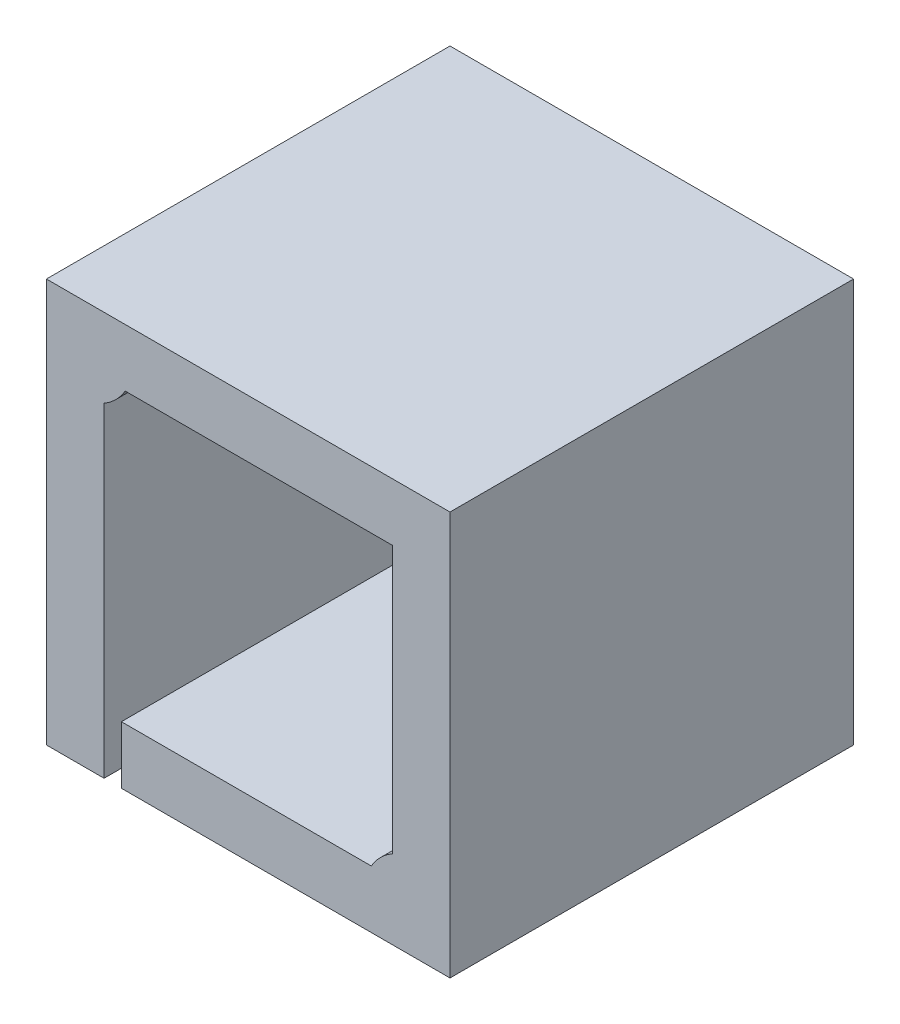
ISO-10303-21;
HEADER;
FILE_DESCRIPTION(('STEP AP214'),'2;1');
FILE_NAME('part.step','',(''),(''),'','','');
FILE_SCHEMA(('AUTOMOTIVE_DESIGN { 1 0 10303 214 1 1 1 1 }'));
ENDSEC;
DATA;
#1=APPLICATION_CONTEXT('core data for automotive mechanical design processes');
#2=APPLICATION_PROTOCOL_DEFINITION('international standard','automotive_design',2000,#1);
#3=PRODUCT_CONTEXT('',#1,'mechanical');
#4=PRODUCT('Part','Part','',(#3));
#5=PRODUCT_RELATED_PRODUCT_CATEGORY('part','',(#4));
#6=PRODUCT_DEFINITION_FORMATION('','',#4);
#7=PRODUCT_DEFINITION_CONTEXT('part definition',#1,'design');
#8=PRODUCT_DEFINITION('design','',#6,#7);
#9=PRODUCT_DEFINITION_SHAPE('','',#8);
#10=(LENGTH_UNIT() NAMED_UNIT(*) SI_UNIT(.MILLI.,.METRE.));
#11=(NAMED_UNIT(*) PLANE_ANGLE_UNIT() SI_UNIT($,.RADIAN.));
#12=(NAMED_UNIT(*) SI_UNIT($,.STERADIAN.) SOLID_ANGLE_UNIT());
#13=UNCERTAINTY_MEASURE_WITH_UNIT(LENGTH_MEASURE(1.E-05),#10,'distance_accuracy_value','');
#14=(GEOMETRIC_REPRESENTATION_CONTEXT(3) GLOBAL_UNCERTAINTY_ASSIGNED_CONTEXT((#13)) GLOBAL_UNIT_ASSIGNED_CONTEXT((#10,
#11,#12)) REPRESENTATION_CONTEXT('',''));
#15=CARTESIAN_POINT('',(0.,0.,0.));
#16=DIRECTION('',(0.,0.,1.));
#17=DIRECTION('',(1.,0.,0.));
#18=AXIS2_PLACEMENT_3D('',#15,#16,#17);
#19=CARTESIAN_POINT('',(-3.,6.5,0.));
#20=DIRECTION('',(0.,0.,1.));
#21=DIRECTION('',(1.,0.,0.));
#22=AXIS2_PLACEMENT_3D('',#19,#20,#21);
#23=CYLINDRICAL_SURFACE('',#22,1.);
#24=DIRECTION('',(0.,0.,-1.));
#25=VECTOR('',#24,1.);
#26=CARTESIAN_POINT('',(-2.133974596216,6.,0.));
#27=LINE('',#26,#25);
#28=CARTESIAN_POINT('',(-2.13397459621578,6.,0.));
#29=VERTEX_POINT('',#28);
#30=CARTESIAN_POINT('',(-2.13397459621578,6.,-7.));
#31=VERTEX_POINT('',#30);
#32=EDGE_CURVE('E107',#29,#31,#27,.T.);
#33=ORIENTED_EDGE('',*,*,#32,.F.);
#34=CARTESIAN_POINT('',(-3.,6.5,0.));
#35=DIRECTION('',(0.,0.,1.));
#36=DIRECTION('',(1.,0.,0.));
#37=AXIS2_PLACEMENT_3D('',#34,#35,#36);
#38=CIRCLE('',#37,1.);
#39=CARTESIAN_POINT('',(-2.5,5.63397459621578,0.));
#40=VERTEX_POINT('',#39);
#41=EDGE_CURVE('E112',#29,#40,#38,.F.);
#42=ORIENTED_EDGE('',*,*,#41,.T.);
#43=DIRECTION('',(0.,0.,1.));
#44=VECTOR('',#43,1.);
#45=CARTESIAN_POINT('',(-2.5,5.633974596216,0.));
#46=LINE('',#45,#44);
#47=CARTESIAN_POINT('',(-2.5,5.63397459621578,-7.));
#48=VERTEX_POINT('',#47);
#49=EDGE_CURVE('E110',#48,#40,#46,.T.);
#50=ORIENTED_EDGE('',*,*,#49,.F.);
#51=CARTESIAN_POINT('',(-3.,6.5,-7.));
#52=DIRECTION('',(0.,0.,1.));
#53=DIRECTION('',(1.,0.,0.));
#54=AXIS2_PLACEMENT_3D('',#51,#52,#53);
#55=CIRCLE('',#54,1.);
#56=EDGE_CURVE('E19',#48,#31,#55,.T.);
#57=ORIENTED_EDGE('',*,*,#56,.T.);
#58=EDGE_LOOP('',(#33,#42,#50,#57));
#59=FACE_BOUND('',#58,.T.);
#60=ADVANCED_FACE('F16',(#59),#23,.T.);
#61=CARTESIAN_POINT('',(3.,0.5,0.));
#62=DIRECTION('',(0.,0.,1.));
#63=DIRECTION('',(1.,0.,0.));
#64=AXIS2_PLACEMENT_3D('',#61,#62,#63);
#65=CYLINDRICAL_SURFACE('',#64,1.);
#66=DIRECTION('',(0.,0.,1.));
#67=VECTOR('',#66,1.);
#68=CARTESIAN_POINT('',(2.133974596216,1.,0.));
#69=LINE('',#68,#67);
#70=CARTESIAN_POINT('',(2.13397459621578,1.,0.));
#71=VERTEX_POINT('',#70);
#72=CARTESIAN_POINT('',(2.13397459621578,1.,-7.));
#73=VERTEX_POINT('',#72);
#74=EDGE_CURVE('E138',#71,#73,#69,.F.);
#75=ORIENTED_EDGE('',*,*,#74,.F.);
#76=CARTESIAN_POINT('',(3.,0.5,0.));
#77=DIRECTION('',(0.,0.,1.));
#78=DIRECTION('',(1.,0.,0.));
#79=AXIS2_PLACEMENT_3D('',#76,#77,#78);
#80=CIRCLE('',#79,1.);
#81=CARTESIAN_POINT('',(2.5,1.36602540378422,0.));
#82=VERTEX_POINT('',#81);
#83=EDGE_CURVE('E173',#71,#82,#80,.F.);
#84=ORIENTED_EDGE('',*,*,#83,.T.);
#85=DIRECTION('',(0.,0.,1.));
#86=VECTOR('',#85,1.);
#87=CARTESIAN_POINT('',(2.5,1.366025403784,0.));
#88=LINE('',#87,#86);
#89=CARTESIAN_POINT('',(2.5,1.36602540378422,-7.));
#90=VERTEX_POINT('',#89);
#91=EDGE_CURVE('E142',#90,#82,#88,.T.);
#92=ORIENTED_EDGE('',*,*,#91,.F.);
#93=CARTESIAN_POINT('',(3.,0.5,-7.));
#94=DIRECTION('',(0.,0.,1.));
#95=DIRECTION('',(1.,0.,0.));
#96=AXIS2_PLACEMENT_3D('',#93,#94,#95);
#97=CIRCLE('',#96,1.);
#98=EDGE_CURVE('E207',#90,#73,#97,.T.);
#99=ORIENTED_EDGE('',*,*,#98,.T.);
#100=EDGE_LOOP('',(#75,#84,#92,#99));
#101=FACE_BOUND('',#100,.T.);
#102=ADVANCED_FACE('F271',(#101),#65,.T.);
#103=CARTESIAN_POINT('',(-3.5,0.,0.));
#104=DIRECTION('',(0.,-1.,0.));
#105=DIRECTION('',(0.,0.,-1.));
#106=AXIS2_PLACEMENT_3D('',#103,#104,#105);
#107=PLANE('',#106);
#108=DIRECTION('',(0.,0.,1.));
#109=VECTOR('',#108,1.);
#110=CARTESIAN_POINT('',(-2.5,0.,0.));
#111=LINE('',#110,#109);
#112=CARTESIAN_POINT('',(-2.5,0.,0.));
#113=VERTEX_POINT('',#112);
#114=CARTESIAN_POINT('',(-2.5,0.,-7.));
#115=VERTEX_POINT('',#114);
#116=EDGE_CURVE('E154',#113,#115,#111,.F.);
#117=ORIENTED_EDGE('',*,*,#116,.F.);
#118=DIRECTION('',(1.,0.,0.));
#119=VECTOR('',#118,1.);
#120=CARTESIAN_POINT('',(-3.5,0.,0.));
#121=LINE('',#120,#119);
#122=CARTESIAN_POINT('',(-3.5,0.,0.));
#123=VERTEX_POINT('',#122);
#124=EDGE_CURVE('E162',#113,#123,#121,.F.);
#125=ORIENTED_EDGE('',*,*,#124,.T.);
#126=DIRECTION('',(0.,0.,1.));
#127=VECTOR('',#126,1.);
#128=CARTESIAN_POINT('',(-3.5,0.,0.));
#129=LINE('',#128,#127);
#130=CARTESIAN_POINT('',(-3.5,0.,-7.));
#131=VERTEX_POINT('',#130);
#132=EDGE_CURVE('E145',#131,#123,#129,.T.);
#133=ORIENTED_EDGE('',*,*,#132,.F.);
#134=DIRECTION('',(1.,0.,0.));
#135=VECTOR('',#134,1.);
#136=CARTESIAN_POINT('',(-3.5,0.,-7.));
#137=LINE('',#136,#135);
#138=EDGE_CURVE('E169',#131,#115,#137,.T.);
#139=ORIENTED_EDGE('',*,*,#138,.T.);
#140=EDGE_LOOP('',(#117,#125,#133,#139));
#141=FACE_BOUND('',#140,.T.);
#142=ADVANCED_FACE('F269',(#141),#107,.T.);
#143=CARTESIAN_POINT('',(-2.2,1.,0.));
#144=DIRECTION('',(-1.,0.,0.));
#145=DIRECTION('',(0.,0.,1.));
#146=AXIS2_PLACEMENT_3D('',#143,#144,#145);
#147=PLANE('',#146);
#148=DIRECTION('',(0.,0.,-1.));
#149=VECTOR('',#148,1.);
#150=CARTESIAN_POINT('',(-2.2,0.,0.));
#151=LINE('',#150,#149);
#152=CARTESIAN_POINT('',(-2.2,0.,0.));
#153=VERTEX_POINT('',#152);
#154=CARTESIAN_POINT('',(-2.2,0.,-7.));
#155=VERTEX_POINT('',#154);
#156=EDGE_CURVE('E129',#153,#155,#151,.T.);
#157=ORIENTED_EDGE('',*,*,#156,.F.);
#158=DIRECTION('',(0.,1.,0.));
#159=VECTOR('',#158,1.);
#160=CARTESIAN_POINT('',(-2.2,1.,0.));
#161=LINE('',#160,#159);
#162=CARTESIAN_POINT('',(-2.2,1.,0.));
#163=VERTEX_POINT('',#162);
#164=EDGE_CURVE('E157',#153,#163,#161,.T.);
#165=ORIENTED_EDGE('',*,*,#164,.T.);
#166=DIRECTION('',(0.,0.,1.));
#167=VECTOR('',#166,1.);
#168=CARTESIAN_POINT('',(-2.2,1.,0.));
#169=LINE('',#168,#167);
#170=CARTESIAN_POINT('',(-2.2,1.,-7.));
#171=VERTEX_POINT('',#170);
#172=EDGE_CURVE('E141',#171,#163,#169,.T.);
#173=ORIENTED_EDGE('',*,*,#172,.F.);
#174=DIRECTION('',(0.,1.,0.));
#175=VECTOR('',#174,1.);
#176=CARTESIAN_POINT('',(-2.2,1.,-7.));
#177=LINE('',#176,#175);
#178=EDGE_CURVE('E160',#171,#155,#177,.F.);
#179=ORIENTED_EDGE('',*,*,#178,.T.);
#180=EDGE_LOOP('',(#157,#165,#173,#179));
#181=FACE_BOUND('',#180,.T.);
#182=ADVANCED_FACE('F243',(#181),#147,.T.);
#183=CARTESIAN_POINT('',(-2.5,0.,0.));
#184=DIRECTION('',(1.,0.,0.));
#185=DIRECTION('',(0.,1.,0.));
#186=AXIS2_PLACEMENT_3D('',#183,#184,#185);
#187=PLANE('',#186);
#188=ORIENTED_EDGE('',*,*,#49,.T.);
#189=DIRECTION('',(0.,1.,0.));
#190=VECTOR('',#189,1.);
#191=CARTESIAN_POINT('',(-2.5,3.414253808474,0.));
#192=LINE('',#191,#190);
#193=EDGE_CURVE('E213',#113,#40,#192,.T.);
#194=ORIENTED_EDGE('',*,*,#193,.F.);
#195=ORIENTED_EDGE('',*,*,#116,.T.);
#196=DIRECTION('',(0.,1.,0.));
#197=VECTOR('',#196,1.);
#198=CARTESIAN_POINT('',(-2.5,3.414253808474,-7.));
#199=LINE('',#198,#197);
#200=EDGE_CURVE('E125',#115,#48,#199,.T.);
#201=ORIENTED_EDGE('',*,*,#200,.T.);
#202=EDGE_LOOP('',(#188,#194,#195,#201));
#203=FACE_BOUND('',#202,.T.);
#204=ADVANCED_FACE('F212',(#203),#187,.T.);
#205=CARTESIAN_POINT('',(-2.133974596216,6.,0.));
#206=DIRECTION('',(0.,-1.,0.));
#207=DIRECTION('',(0.,0.,-1.));
#208=AXIS2_PLACEMENT_3D('',#205,#206,#207);
#209=PLANE('',#208);
#210=DIRECTION('',(0.,0.,1.));
#211=VECTOR('',#210,1.);
#212=CARTESIAN_POINT('',(2.5,6.,0.));
#213=LINE('',#212,#211);
#214=CARTESIAN_POINT('',(2.5,6.,0.));
#215=VERTEX_POINT('',#214);
#216=CARTESIAN_POINT('',(2.5,6.,-7.));
#217=VERTEX_POINT('',#216);
#218=EDGE_CURVE('E119',#215,#217,#213,.F.);
#219=ORIENTED_EDGE('',*,*,#218,.F.);
#220=DIRECTION('',(1.,0.,0.));
#221=VECTOR('',#220,1.);
#222=CARTESIAN_POINT('',(-0.06716785002867,6.,0.));
#223=LINE('',#222,#221);
#224=EDGE_CURVE('E118',#29,#215,#223,.T.);
#225=ORIENTED_EDGE('',*,*,#224,.F.);
#226=ORIENTED_EDGE('',*,*,#32,.T.);
#227=DIRECTION('',(1.,0.,0.));
#228=VECTOR('',#227,1.);
#229=CARTESIAN_POINT('',(-0.06716785002867,6.,-7.));
#230=LINE('',#229,#228);
#231=EDGE_CURVE('E115',#31,#217,#230,.T.);
#232=ORIENTED_EDGE('',*,*,#231,.T.);
#233=EDGE_LOOP('',(#219,#225,#226,#232));
#234=FACE_BOUND('',#233,.T.);
#235=ADVANCED_FACE('F114',(#234),#209,.T.);
#236=CARTESIAN_POINT('',(2.5,6.,0.));
#237=DIRECTION('',(-1.,0.,0.));
#238=DIRECTION('',(0.,0.,1.));
#239=AXIS2_PLACEMENT_3D('',#236,#237,#238);
#240=PLANE('',#239);
#241=ORIENTED_EDGE('',*,*,#91,.T.);
#242=DIRECTION('',(0.,1.,0.));
#243=VECTOR('',#242,1.);
#244=CARTESIAN_POINT('',(2.5,3.414253808474,0.));
#245=LINE('',#244,#243);
#246=EDGE_CURVE('E218',#215,#82,#245,.F.);
#247=ORIENTED_EDGE('',*,*,#246,.F.);
#248=ORIENTED_EDGE('',*,*,#218,.T.);
#249=DIRECTION('',(0.,1.,0.));
#250=VECTOR('',#249,1.);
#251=CARTESIAN_POINT('',(2.5,3.414253808474,-7.));
#252=LINE('',#251,#250);
#253=EDGE_CURVE('E124',#217,#90,#252,.F.);
#254=ORIENTED_EDGE('',*,*,#253,.T.);
#255=EDGE_LOOP('',(#241,#247,#248,#254));
#256=FACE_BOUND('',#255,.T.);
#257=ADVANCED_FACE('F299',(#256),#240,.T.);
#258=CARTESIAN_POINT('',(2.133974596216,1.,0.));
#259=DIRECTION('',(0.,1.,0.));
#260=DIRECTION('',(0.,0.,1.));
#261=AXIS2_PLACEMENT_3D('',#258,#259,#260);
#262=PLANE('',#261);
#263=ORIENTED_EDGE('',*,*,#172,.T.);
#264=DIRECTION('',(1.,0.,0.));
#265=VECTOR('',#264,1.);
#266=CARTESIAN_POINT('',(-0.06716785002867,1.,0.));
#267=LINE('',#266,#265);
#268=EDGE_CURVE('E183',#71,#163,#267,.F.);
#269=ORIENTED_EDGE('',*,*,#268,.F.);
#270=ORIENTED_EDGE('',*,*,#74,.T.);
#271=DIRECTION('',(1.,0.,0.));
#272=VECTOR('',#271,1.);
#273=CARTESIAN_POINT('',(-0.06716785002867,1.,-7.));
#274=LINE('',#273,#272);
#275=EDGE_CURVE('E127',#73,#171,#274,.F.);
#276=ORIENTED_EDGE('',*,*,#275,.T.);
#277=EDGE_LOOP('',(#263,#269,#270,#276));
#278=FACE_BOUND('',#277,.T.);
#279=ADVANCED_FACE('F233',(#278),#262,.T.);
#280=CARTESIAN_POINT('',(-3.5,7.,0.));
#281=DIRECTION('',(-1.,0.,0.));
#282=DIRECTION('',(0.,0.,1.));
#283=AXIS2_PLACEMENT_3D('',#280,#281,#282);
#284=PLANE('',#283);
#285=ORIENTED_EDGE('',*,*,#132,.T.);
#286=DIRECTION('',(0.,1.,0.));
#287=VECTOR('',#286,1.);
#288=CARTESIAN_POINT('',(-3.5,3.414253808474,0.));
#289=LINE('',#288,#287);
#290=CARTESIAN_POINT('',(-3.5,7.,0.));
#291=VERTEX_POINT('',#290);
#292=EDGE_CURVE('E195',#291,#123,#289,.F.);
#293=ORIENTED_EDGE('',*,*,#292,.F.);
#294=DIRECTION('',(0.,0.,1.));
#295=VECTOR('',#294,1.);
#296=CARTESIAN_POINT('',(-3.5,7.,0.));
#297=LINE('',#296,#295);
#298=CARTESIAN_POINT('',(-3.5,7.,-7.));
#299=VERTEX_POINT('',#298);
#300=EDGE_CURVE('E216',#299,#291,#297,.T.);
#301=ORIENTED_EDGE('',*,*,#300,.F.);
#302=DIRECTION('',(0.,1.,0.));
#303=VECTOR('',#302,1.);
#304=CARTESIAN_POINT('',(-3.5,3.414253808474,-7.));
#305=LINE('',#304,#303);
#306=EDGE_CURVE('E188',#299,#131,#305,.F.);
#307=ORIENTED_EDGE('',*,*,#306,.T.);
#308=EDGE_LOOP('',(#285,#293,#301,#307));
#309=FACE_BOUND('',#308,.T.);
#310=ADVANCED_FACE('F267',(#309),#284,.T.);
#311=CARTESIAN_POINT('',(-2.2,0.,0.));
#312=DIRECTION('',(0.,-1.,0.));
#313=DIRECTION('',(0.,0.,-1.));
#314=AXIS2_PLACEMENT_3D('',#311,#312,#313);
#315=PLANE('',#314);
#316=DIRECTION('',(0.,0.,-1.));
#317=VECTOR('',#316,1.);
#318=CARTESIAN_POINT('',(3.5,0.,0.));
#319=LINE('',#318,#317);
#320=CARTESIAN_POINT('',(3.5,0.,0.));
#321=VERTEX_POINT('',#320);
#322=CARTESIAN_POINT('',(3.5,0.,-7.));
#323=VERTEX_POINT('',#322);
#324=EDGE_CURVE('E198',#321,#323,#319,.T.);
#325=ORIENTED_EDGE('',*,*,#324,.F.);
#326=DIRECTION('',(1.,0.,0.));
#327=VECTOR('',#326,1.);
#328=CARTESIAN_POINT('',(-0.06716785002867,0.,0.));
#329=LINE('',#328,#327);
#330=EDGE_CURVE('E180',#153,#321,#329,.T.);
#331=ORIENTED_EDGE('',*,*,#330,.F.);
#332=ORIENTED_EDGE('',*,*,#156,.T.);
#333=DIRECTION('',(1.,0.,0.));
#334=VECTOR('',#333,1.);
#335=CARTESIAN_POINT('',(-0.06716785002867,0.,-7.));
#336=LINE('',#335,#334);
#337=EDGE_CURVE('E186',#155,#323,#336,.T.);
#338=ORIENTED_EDGE('',*,*,#337,.T.);
#339=EDGE_LOOP('',(#325,#331,#332,#338));
#340=FACE_BOUND('',#339,.T.);
#341=ADVANCED_FACE('F291',(#340),#315,.T.);
#342=CARTESIAN_POINT('',(-0.06716785002867,3.414253808474,-7.));
#343=DIRECTION('',(0.,0.,1.));
#344=DIRECTION('',(1.,0.,0.));
#345=AXIS2_PLACEMENT_3D('',#342,#343,#344);
#346=PLANE('',#345);
#347=ORIENTED_EDGE('',*,*,#306,.F.);
#348=DIRECTION('',(1.,0.,0.));
#349=VECTOR('',#348,1.);
#350=CARTESIAN_POINT('',(3.5,7.,-7.));
#351=LINE('',#350,#349);
#352=CARTESIAN_POINT('',(3.5,7.,-7.));
#353=VERTEX_POINT('',#352);
#354=EDGE_CURVE('E203',#353,#299,#351,.F.);
#355=ORIENTED_EDGE('',*,*,#354,.F.);
#356=DIRECTION('',(0.,1.,0.));
#357=VECTOR('',#356,1.);
#358=CARTESIAN_POINT('',(3.5,0.,-7.));
#359=LINE('',#358,#357);
#360=EDGE_CURVE('E256',#323,#353,#359,.T.);
#361=ORIENTED_EDGE('',*,*,#360,.F.);
#362=ORIENTED_EDGE('',*,*,#337,.F.);
#363=ORIENTED_EDGE('',*,*,#178,.F.);
#364=ORIENTED_EDGE('',*,*,#275,.F.);
#365=ORIENTED_EDGE('',*,*,#98,.F.);
#366=ORIENTED_EDGE('',*,*,#253,.F.);
#367=ORIENTED_EDGE('',*,*,#231,.F.);
#368=ORIENTED_EDGE('',*,*,#56,.F.);
#369=ORIENTED_EDGE('',*,*,#200,.F.);
#370=ORIENTED_EDGE('',*,*,#138,.F.);
#371=EDGE_LOOP('',(#347,#355,#361,#362,#363,#364,#365,#366,#367,#368,#369,#370));
#372=FACE_BOUND('',#371,.T.);
#373=ADVANCED_FACE('F122',(#372),#346,.F.);
#374=CARTESIAN_POINT('',(3.5,7.,0.));
#375=DIRECTION('',(0.,1.,0.));
#376=DIRECTION('',(0.,0.,1.));
#377=AXIS2_PLACEMENT_3D('',#374,#375,#376);
#378=PLANE('',#377);
#379=ORIENTED_EDGE('',*,*,#300,.T.);
#380=DIRECTION('',(1.,0.,0.));
#381=VECTOR('',#380,1.);
#382=CARTESIAN_POINT('',(-0.06716785002867,7.,0.));
#383=LINE('',#382,#381);
#384=CARTESIAN_POINT('',(3.5,7.,0.));
#385=VERTEX_POINT('',#384);
#386=EDGE_CURVE('E34',#385,#291,#383,.F.);
#387=ORIENTED_EDGE('',*,*,#386,.F.);
#388=DIRECTION('',(0.,0.,-1.));
#389=VECTOR('',#388,1.);
#390=CARTESIAN_POINT('',(3.5,7.,0.));
#391=LINE('',#390,#389);
#392=EDGE_CURVE('E25',#353,#385,#391,.F.);
#393=ORIENTED_EDGE('',*,*,#392,.F.);
#394=ORIENTED_EDGE('',*,*,#354,.T.);
#395=EDGE_LOOP('',(#379,#387,#393,#394));
#396=FACE_BOUND('',#395,.T.);
#397=ADVANCED_FACE('F262',(#396),#378,.T.);
#398=CARTESIAN_POINT('',(-0.06716785002867,3.414253808474,0.));
#399=DIRECTION('',(0.,0.,1.));
#400=DIRECTION('',(1.,0.,0.));
#401=AXIS2_PLACEMENT_3D('',#398,#399,#400);
#402=PLANE('',#401);
#403=ORIENTED_EDGE('',*,*,#292,.T.);
#404=ORIENTED_EDGE('',*,*,#124,.F.);
#405=ORIENTED_EDGE('',*,*,#193,.T.);
#406=ORIENTED_EDGE('',*,*,#41,.F.);
#407=ORIENTED_EDGE('',*,*,#224,.T.);
#408=ORIENTED_EDGE('',*,*,#246,.T.);
#409=ORIENTED_EDGE('',*,*,#83,.F.);
#410=ORIENTED_EDGE('',*,*,#268,.T.);
#411=ORIENTED_EDGE('',*,*,#164,.F.);
#412=ORIENTED_EDGE('',*,*,#330,.T.);
#413=DIRECTION('',(0.,1.,0.));
#414=VECTOR('',#413,1.);
#415=CARTESIAN_POINT('',(3.5,0.,0.));
#416=LINE('',#415,#414);
#417=EDGE_CURVE('E11',#385,#321,#416,.F.);
#418=ORIENTED_EDGE('',*,*,#417,.F.);
#419=ORIENTED_EDGE('',*,*,#386,.T.);
#420=EDGE_LOOP('',(#403,#404,#405,#406,#407,#408,#409,#410,#411,#412,#418,#419));
#421=FACE_BOUND('',#420,.T.);
#422=ADVANCED_FACE('F214',(#421),#402,.T.);
#423=CARTESIAN_POINT('',(3.5,0.,0.));
#424=DIRECTION('',(1.,0.,0.));
#425=DIRECTION('',(0.,0.,-1.));
#426=AXIS2_PLACEMENT_3D('',#423,#424,#425);
#427=PLANE('',#426);
#428=ORIENTED_EDGE('',*,*,#392,.T.);
#429=ORIENTED_EDGE('',*,*,#417,.T.);
#430=ORIENTED_EDGE('',*,*,#324,.T.);
#431=ORIENTED_EDGE('',*,*,#360,.T.);
#432=EDGE_LOOP('',(#428,#429,#430,#431));
#433=FACE_BOUND('',#432,.T.);
#434=ADVANCED_FACE('F261',(#433),#427,.T.);
#435=CLOSED_SHELL('',(#60,#102,#142,#182,#204,#235,#257,#279,#310,#341,#373,#397,#422,#434));
#436=MANIFOLD_SOLID_BREP('B1',#435);
#437=ADVANCED_BREP_SHAPE_REPRESENTATION('',(#18,#436),#14);
#438=SHAPE_DEFINITION_REPRESENTATION(#9,#437);
ENDSEC;
END-ISO-10303-21;
